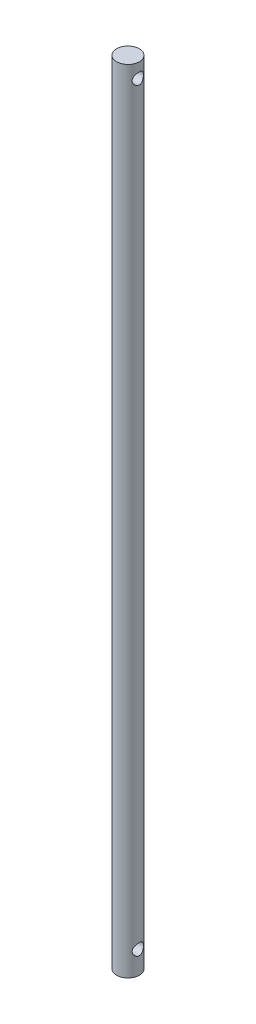
ISO-10303-21;
HEADER;
FILE_DESCRIPTION(('STEP AP214'),'2;1');
FILE_NAME('part.step','',(''),(''),'','','');
FILE_SCHEMA(('AUTOMOTIVE_DESIGN { 1 0 10303 214 1 1 1 1 }'));
ENDSEC;
DATA;
#1=APPLICATION_CONTEXT('core data for automotive mechanical design processes');
#2=APPLICATION_PROTOCOL_DEFINITION('international standard','automotive_design',2000,#1);
#3=PRODUCT_CONTEXT('',#1,'mechanical');
#4=PRODUCT('Part','Part','',(#3));
#5=PRODUCT_RELATED_PRODUCT_CATEGORY('part','',(#4));
#6=PRODUCT_DEFINITION_FORMATION('','',#4);
#7=PRODUCT_DEFINITION_CONTEXT('part definition',#1,'design');
#8=PRODUCT_DEFINITION('design','',#6,#7);
#9=PRODUCT_DEFINITION_SHAPE('','',#8);
#10=(LENGTH_UNIT() NAMED_UNIT(*) SI_UNIT(.MILLI.,.METRE.));
#11=(NAMED_UNIT(*) PLANE_ANGLE_UNIT() SI_UNIT($,.RADIAN.));
#12=(NAMED_UNIT(*) SI_UNIT($,.STERADIAN.) SOLID_ANGLE_UNIT());
#13=UNCERTAINTY_MEASURE_WITH_UNIT(LENGTH_MEASURE(1.E-05),#10,'distance_accuracy_value','');
#14=(GEOMETRIC_REPRESENTATION_CONTEXT(3) GLOBAL_UNCERTAINTY_ASSIGNED_CONTEXT((#13)) GLOBAL_UNIT_ASSIGNED_CONTEXT((#10,
#11,#12)) REPRESENTATION_CONTEXT('',''));
#15=CARTESIAN_POINT('',(0.,0.,0.));
#16=DIRECTION('',(0.,0.,1.));
#17=DIRECTION('',(1.,0.,0.));
#18=AXIS2_PLACEMENT_3D('',#15,#16,#17);
#19=CARTESIAN_POINT('',(0.,350.,0.));
#20=DIRECTION('',(0.,1.,0.));
#21=DIRECTION('',(0.,0.,1.));
#22=AXIS2_PLACEMENT_3D('',#19,#20,#21);
#23=PLANE('',#22);
#24=CARTESIAN_POINT('',(0.,350.,0.));
#25=DIRECTION('',(0.,1.,0.));
#26=DIRECTION('',(0.,0.,1.));
#27=AXIS2_PLACEMENT_3D('',#24,#25,#26);
#28=CIRCLE('',#27,5.);
#29=CARTESIAN_POINT('',(0.,350.,5.));
#30=VERTEX_POINT('',#29);
#31=EDGE_CURVE('E10',#30,#30,#28,.T.);
#32=ORIENTED_EDGE('',*,*,#31,.T.);
#33=EDGE_LOOP('',(#32));
#34=FACE_BOUND('',#33,.T.);
#35=ADVANCED_FACE('F44',(#34),#23,.T.);
#36=CARTESIAN_POINT('',(0.,0.,0.));
#37=DIRECTION('',(0.,1.,0.));
#38=DIRECTION('',(0.,0.,1.));
#39=AXIS2_PLACEMENT_3D('',#36,#37,#38);
#40=PLANE('',#39);
#41=CARTESIAN_POINT('',(0.,0.,0.));
#42=DIRECTION('',(0.,1.,0.));
#43=DIRECTION('',(0.,0.,1.));
#44=AXIS2_PLACEMENT_3D('',#41,#42,#43);
#45=CIRCLE('',#44,5.);
#46=CARTESIAN_POINT('',(0.,0.,5.));
#47=VERTEX_POINT('',#46);
#48=EDGE_CURVE('E59',#47,#47,#45,.T.);
#49=ORIENTED_EDGE('',*,*,#48,.F.);
#50=EDGE_LOOP('',(#49));
#51=FACE_BOUND('',#50,.T.);
#52=ADVANCED_FACE('F107',(#51),#40,.F.);
#53=CARTESIAN_POINT('',(0.,350.,0.));
#54=DIRECTION('',(0.,-1.,0.));
#55=DIRECTION('',(0.,0.,-1.));
#56=AXIS2_PLACEMENT_3D('',#53,#54,#55);
#57=CYLINDRICAL_SURFACE('',#56,5.);
#58=CARTESIAN_POINT('',(-4.33012701892219,343.604340322593,-2.5));
#59=CARTESIAN_POINT('',(-4.33013982272992,343.73460682947,-2.49998948436432));
#60=CARTESIAN_POINT('',(-4.33609541965583,343.86504304327,-2.48974954513168));
#61=CARTESIAN_POINT('',(-4.35905877051907,344.121909294123,-2.44930840724944));
#62=CARTESIAN_POINT('',(-4.37608974726023,344.248330326651,-2.41906526369545));
#63=CARTESIAN_POINT('',(-4.41873376871658,344.492969268154,-2.34024976997571));
#64=CARTESIAN_POINT('',(-4.4443011133892,344.611226896155,-2.29177485369965));
#65=CARTESIAN_POINT('',(-4.50106659111455,344.837900885688,-2.17816884056416));
#66=CARTESIAN_POINT('',(-4.53226502875883,344.946316714389,-2.1130368426267));
#67=CARTESIAN_POINT('',(-4.59992173524852,345.16010462651,-1.96166634317251));
#68=CARTESIAN_POINT('',(-4.63660159331578,345.264488157083,-1.87413008816916));
#69=CARTESIAN_POINT('',(-4.70929956727452,345.457861298307,-1.68313452122752));
#70=CARTESIAN_POINT('',(-4.74531734512768,345.546843230348,-1.57966731506053));
#71=CARTESIAN_POINT('',(-4.81553692452134,345.712758199079,-1.35122390789083));
#72=CARTESIAN_POINT('',(-4.84945266064072,345.788474741872,-1.22526797235895));
#73=CARTESIAN_POINT('',(-4.90876890230194,345.917192456077,-0.960392566671129));
#74=CARTESIAN_POINT('',(-4.93417477954535,345.970207963032,-0.82148134538995));
#75=CARTESIAN_POINT('',(-4.9720115311507,346.048101975757,-0.545112359773481));
#76=CARTESIAN_POINT('',(-4.98523700553426,346.074714138458,-0.408254476210946));
#77=CARTESIAN_POINT('',(-5.00018959613973,346.104755619305,-0.13142657175565));
#78=CARTESIAN_POINT('',(-5.00192366961168,346.108198964589,0.00854151460652827));
#79=CARTESIAN_POINT('',(-4.99407454791405,346.092473637662,0.274581311061977));
#80=CARTESIAN_POINT('',(-4.98546239730476,346.075245283789,0.400802997942683));
#81=CARTESIAN_POINT('',(-4.95935613149294,346.022138212833,0.64828442979512));
#82=CARTESIAN_POINT('',(-4.94186135165964,345.986258100153,0.769543802734635));
#83=CARTESIAN_POINT('',(-4.89928958219156,345.896633907368,1.00577347892408));
#84=CARTESIAN_POINT('',(-4.87411103823003,345.842649539663,1.12063355878801));
#85=CARTESIAN_POINT('',(-4.81844114966712,345.71868178209,1.33994200378329));
#86=CARTESIAN_POINT('',(-4.78794790393708,345.648692664337,1.44438662209662));
#87=CARTESIAN_POINT('',(-4.72110985998074,345.487101943761,1.65043415224552));
#88=CARTESIAN_POINT('',(-4.68448439995438,345.394082751778,1.75083518757341));
#89=CARTESIAN_POINT('',(-4.61135851467029,345.192866010268,1.93526092574445));
#90=CARTESIAN_POINT('',(-4.57485820664072,345.084656891908,2.01927302893557));
#91=CARTESIAN_POINT('',(-4.50360390231212,344.847719841533,2.17376333660552));
#92=CARTESIAN_POINT('',(-4.46910799976769,344.718125264958,2.24304328744512));
#93=CARTESIAN_POINT('',(-4.4093862569644,344.446996144196,2.35829778250307));
#94=CARTESIAN_POINT('',(-4.38415075115169,344.305474240049,2.40429664552722));
#95=CARTESIAN_POINT('',(-4.34861589542586,344.026304044386,2.4679505275626));
#96=CARTESIAN_POINT('',(-4.33729139621241,343.889237524984,2.48756280529994));
#97=CARTESIAN_POINT('',(-4.32794798404024,343.613336968802,2.50379236652857));
#98=CARTESIAN_POINT('',(-4.32991967223279,343.474504249794,2.50042589328757));
#99=CARTESIAN_POINT('',(-4.34585841351463,343.215205526146,2.4725901083599));
#100=CARTESIAN_POINT('',(-4.35848968766637,343.094391694823,2.45046954178113));
#101=CARTESIAN_POINT('',(-4.39235053878354,342.858420856916,2.38924071158109));
#102=CARTESIAN_POINT('',(-4.41358290012586,342.743265695726,2.35012694655906));
#103=CARTESIAN_POINT('',(-4.46340555199143,342.515811995337,2.25411897151213));
#104=CARTESIAN_POINT('',(-4.49229108107659,342.403892780461,2.19648515923158));
#105=CARTESIAN_POINT('',(-4.55390298743127,342.190667143744,2.06571766003965));
#106=CARTESIAN_POINT('',(-4.58663133387874,342.089366213805,1.99257601083119));
#107=CARTESIAN_POINT('',(-4.65719996140837,341.88689340379,1.82209291799633));
#108=CARTESIAN_POINT('',(-4.69516457885708,341.787347445821,1.72286318078432));
#109=CARTESIAN_POINT('',(-4.76835587444747,341.605809727587,1.50851123849876));
#110=CARTESIAN_POINT('',(-4.8035816251933,341.523823896935,1.39338368664984));
#111=CARTESIAN_POINT('',(-4.86853404227336,341.377906007802,1.14633840638502));
#112=CARTESIAN_POINT('',(-4.89809104179856,341.314507527385,1.01405774389057));
#113=CARTESIAN_POINT('',(-4.94708387398471,341.211495562631,0.73880591164729));
#114=CARTESIAN_POINT('',(-4.96652859191746,341.171861192988,0.595844253647031));
#115=CARTESIAN_POINT('',(-4.99168770453968,341.120918913237,0.317449205674674));
#116=CARTESIAN_POINT('',(-4.99849819767838,341.107345636763,0.182528609085344));
#117=CARTESIAN_POINT('',(-5.00105325940467,341.102232155099,-0.0878149643374635));
#118=CARTESIAN_POINT('',(-4.99680170177041,341.110684236932,-0.223237748727049));
#119=CARTESIAN_POINT('',(-4.97834922085636,341.147881352989,-0.481344982671107));
#120=CARTESIAN_POINT('',(-4.96482236636806,341.17525249423,-0.604280801321809));
#121=CARTESIAN_POINT('',(-4.9298023419173,341.247657772352,-0.84361487366449));
#122=CARTESIAN_POINT('',(-4.90830802955517,341.292694442227,-0.960012187087246));
#123=CARTESIAN_POINT('',(-4.85814826741487,341.401158141333,-1.18855854199596));
#124=CARTESIAN_POINT('',(-4.82921542506801,341.465289347283,-1.30031295715367));
#125=CARTESIAN_POINT('',(-4.76720333344985,341.609234432741,-1.51193650408538));
#126=CARTESIAN_POINT('',(-4.73412218229104,341.68905551522,-1.61180014305398));
#127=CARTESIAN_POINT('',(-4.66321523550925,341.871336117043,-1.80728542324369));
#128=CARTESIAN_POINT('',(-4.62524489658366,341.975258048594,-1.90149582349004));
#129=CARTESIAN_POINT('',(-4.5515769828494,342.197955607975,-2.07165660492506));
#130=CARTESIAN_POINT('',(-4.51588143910584,342.316744236793,-2.14759083151541));
#131=CARTESIAN_POINT('',(-4.44998982823925,342.570976440258,-2.2810839339603));
#132=CARTESIAN_POINT('',(-4.42000320346983,342.706827711018,-2.33798627977452));
#133=CARTESIAN_POINT('',(-4.38370272660092,342.917562972113,-2.40494911880461));
#134=CARTESIAN_POINT('',(-4.37305486646053,342.988900098291,-2.42419582683993));
#135=CARTESIAN_POINT('',(-4.35507574170934,343.133381019443,-2.4563508725579));
#136=CARTESIAN_POINT('',(-4.34774215854234,343.206523513548,-2.46926364179177));
#137=CARTESIAN_POINT('',(-4.3382377954292,343.33384130914,-2.48591166201423));
#138=CARTESIAN_POINT('',(-4.33520487024791,343.387756644105,-2.49118864979202));
#139=CARTESIAN_POINT('',(-4.33114674911323,343.495884938904,-2.49823512543934));
#140=CARTESIAN_POINT('',(-4.33012168747261,343.550097918404,-2.50000437866475));
#141=CARTESIAN_POINT('',(-4.33012701892219,343.604340322593,-2.5));
#142=B_SPLINE_CURVE_WITH_KNOTS('',3,(#58,#59,#60,#61,#62,#63,#64,#65,#66,#67,#68,#69,#70,#71,
#72,#73,#74,#75,#76,#77,#78,#79,#80,#81,#82,#83,#84,#85,#86,#87,#88,#89,#90,#91,#92,#93,#94,#95,
#96,#97,#98,#99,#100,#101,#102,#103,#104,#105,#106,#107,#108,#109,#110,#111,#112,#113,#114,#115,
#116,#117,#118,#119,#120,#121,#122,#123,#124,#125,#126,#127,#128,#129,#130,#131,#132,#133,#134,
#135,#136,#137,#138,#139,#140,#141),.UNSPECIFIED.,.T.,.F.,(4,2,2,2,2,2,2,2,2,2,2,2,2,2,2,2,2,2,
2,2,2,2,2,2,2,2,2,2,2,2,2,2,2,2,2,2,2,2,2,2,2,4),(0.,0.390580306486788,0.781982232062008,
1.17132148982688,1.56068181366373,1.98215578129643,2.4038392771601,2.85394730601993,
3.30377067414815,3.72158712424925,4.13915059220185,4.5204024371643,4.90168281298724,
5.28823836832953,5.67493248380766,6.09817978647308,6.5217512061988,6.97222104328701,
7.42221935534342,7.83655727140614,8.25060232976027,8.61935458565156,8.98822631095252,
9.37418241020316,9.76033715555206,10.1951685895662,10.630146624506,11.076604535375,
11.5226694952702,11.9278067597881,12.3328021699002,12.7111106218382,13.0894733378512,
13.4840187680377,13.8787457525688,14.3127560463025,14.7471485711797,15.1952687260161,
15.418924415395,15.6424233996908,15.8050484542806,15.9676843870379),.UNSPECIFIED.);
#143=CARTESIAN_POINT('',(-4.33012701892219,343.604340322593,-2.5));
#144=VERTEX_POINT('',#143);
#145=EDGE_CURVE('E49',#144,#144,#142,.T.);
#146=ORIENTED_EDGE('',*,*,#145,.T.);
#147=EDGE_LOOP('',(#146));
#148=FACE_BOUND('',#147,.T.);
#149=CARTESIAN_POINT('',(4.33012701892219,343.604340322593,-2.5));
#150=CARTESIAN_POINT('',(4.33013982272992,343.474073815717,-2.49998948436432));
#151=CARTESIAN_POINT('',(4.33609541965583,343.343637601917,-2.48974954513168));
#152=CARTESIAN_POINT('',(4.35905877051907,343.086771351064,-2.44930840724944));
#153=CARTESIAN_POINT('',(4.37608974726023,342.960350318536,-2.41906526369545));
#154=CARTESIAN_POINT('',(4.41873376871659,342.715711377032,-2.3402497699757));
#155=CARTESIAN_POINT('',(4.44430111338921,342.597453749031,-2.29177485369963));
#156=CARTESIAN_POINT('',(4.50106659111456,342.370779759499,-2.17816884056413));
#157=CARTESIAN_POINT('',(4.53226502875884,342.262363930798,-2.11303684262669));
#158=CARTESIAN_POINT('',(4.59992173524852,342.048576018676,-1.96166634317251));
#159=CARTESIAN_POINT('',(4.63660159331578,341.944192488104,-1.87413008816916));
#160=CARTESIAN_POINT('',(4.70929956727452,341.75081934688,-1.68313452122752));
#161=CARTESIAN_POINT('',(4.74531734512768,341.661837414838,-1.57966731506053));
#162=CARTESIAN_POINT('',(4.81553692452134,341.495922446108,-1.35122390789083));
#163=CARTESIAN_POINT('',(4.84945266064072,341.420205903314,-1.22526797235895));
#164=CARTESIAN_POINT('',(4.90876890230194,341.291488189109,-0.960392566671129));
#165=CARTESIAN_POINT('',(4.93417477954535,341.238472682155,-0.82148134538995));
#166=CARTESIAN_POINT('',(4.9720115311507,341.160578669429,-0.545112359773481));
#167=CARTESIAN_POINT('',(4.98523700553426,341.133966506728,-0.408254476210946));
#168=CARTESIAN_POINT('',(5.00018959613973,341.103925025882,-0.131426571755651));
#169=CARTESIAN_POINT('',(5.00192366961168,341.100481680598,0.00854151460652814));
#170=CARTESIAN_POINT('',(4.99407454791405,341.116207007525,0.274581311061981));
#171=CARTESIAN_POINT('',(4.98546239730476,341.133435361398,0.400802997942691));
#172=CARTESIAN_POINT('',(4.95935613149293,341.186542432353,0.648284429795127));
#173=CARTESIAN_POINT('',(4.94186135165964,341.222422545034,0.769543802734639));
#174=CARTESIAN_POINT('',(4.89928958219156,341.312046737818,1.00577347892408));
#175=CARTESIAN_POINT('',(4.87411103823003,341.366031105524,1.12063355878801));
#176=CARTESIAN_POINT('',(4.81844114966712,341.489998863097,1.33994200378329));
#177=CARTESIAN_POINT('',(4.78794790393708,341.559987980849,1.44438662209662));
#178=CARTESIAN_POINT('',(4.72110985998074,341.721578701426,1.65043415224552));
#179=CARTESIAN_POINT('',(4.68448439995438,341.814597893408,1.75083518757341));
#180=CARTESIAN_POINT('',(4.61135851467029,342.015814634919,1.93526092574445));
#181=CARTESIAN_POINT('',(4.57485820664072,342.124023753278,2.01927302893557));
#182=CARTESIAN_POINT('',(4.50360390231212,342.360960803654,2.17376333660552));
#183=CARTESIAN_POINT('',(4.46910799976769,342.490555380229,2.24304328744512));
#184=CARTESIAN_POINT('',(4.4093862569644,342.761684500991,2.35829778250307));
#185=CARTESIAN_POINT('',(4.38415075115169,342.903206405137,2.40429664552722));
#186=CARTESIAN_POINT('',(4.34861589542586,343.1823766008,2.46795052756259));
#187=CARTESIAN_POINT('',(4.33729139621241,343.319443120202,2.48756280529993));
#188=CARTESIAN_POINT('',(4.32794798404024,343.595343676385,2.50379236652857));
#189=CARTESIAN_POINT('',(4.32991967223279,343.734176395393,2.50042589328757));
#190=CARTESIAN_POINT('',(4.34585841351463,343.99347511904,2.4725901083599));
#191=CARTESIAN_POINT('',(4.35848968766637,344.114288950363,2.45046954178113));
#192=CARTESIAN_POINT('',(4.39235053878354,344.350259788271,2.38924071158109));
#193=CARTESIAN_POINT('',(4.41358290012586,344.46541494946,2.35012694655906));
#194=CARTESIAN_POINT('',(4.46340555199142,344.69286864985,2.25411897151215));
#195=CARTESIAN_POINT('',(4.49229108107658,344.804787864726,2.1964851592316));
#196=CARTESIAN_POINT('',(4.55390298743126,345.018013501442,2.06571766003968));
#197=CARTESIAN_POINT('',(4.58663133387873,345.119314431381,1.99257601083121));
#198=CARTESIAN_POINT('',(4.65719996140837,345.321787241397,1.82209291799633));
#199=CARTESIAN_POINT('',(4.69516457885708,345.421333199366,1.72286318078432));
#200=CARTESIAN_POINT('',(4.76835587444747,345.602870917599,1.50851123849876));
#201=CARTESIAN_POINT('',(4.8035816251933,345.684856748252,1.39338368664984));
#202=CARTESIAN_POINT('',(4.86853404227336,345.830774637384,1.14633840638502));
#203=CARTESIAN_POINT('',(4.89809104179856,345.894173117802,1.01405774389057));
#204=CARTESIAN_POINT('',(4.94708387398471,345.997185082555,0.73880591164729));
#205=CARTESIAN_POINT('',(4.96652859191746,346.036819452198,0.595844253647031));
#206=CARTESIAN_POINT('',(4.99168770453968,346.08776173195,0.317449205674674));
#207=CARTESIAN_POINT('',(4.99849819767838,346.101335008424,0.182528609085344));
#208=CARTESIAN_POINT('',(5.00105325940467,346.106448490088,-0.0878149643374642));
#209=CARTESIAN_POINT('',(4.99680170177041,346.097996408254,-0.223237748727049));
#210=CARTESIAN_POINT('',(4.97834922085636,346.060799292198,-0.481344982671107));
#211=CARTESIAN_POINT('',(4.96482236636806,346.033428150957,-0.604280801321809));
#212=CARTESIAN_POINT('',(4.9298023419173,345.961022872835,-0.84361487366449));
#213=CARTESIAN_POINT('',(4.90830802955517,345.91598620296,-0.960012187087246));
#214=CARTESIAN_POINT('',(4.85814826741487,345.807522503854,-1.18855854199596));
#215=CARTESIAN_POINT('',(4.82921542506801,345.743391297903,-1.30031295715367));
#216=CARTESIAN_POINT('',(4.76720333344985,345.599446212446,-1.51193650408538));
#217=CARTESIAN_POINT('',(4.73412218229104,345.519625129966,-1.61180014305398));
#218=CARTESIAN_POINT('',(4.66321523550925,345.337344528144,-1.80728542324369));
#219=CARTESIAN_POINT('',(4.62524489658366,345.233422596593,-1.90149582349004));
#220=CARTESIAN_POINT('',(4.5515769828494,345.010725037211,-2.07165660492506));
#221=CARTESIAN_POINT('',(4.51588143910584,344.891936408394,-2.14759083151541));
#222=CARTESIAN_POINT('',(4.44998982823925,344.637704204929,-2.2810839339603));
#223=CARTESIAN_POINT('',(4.42000320346983,344.501852934169,-2.33798627977452));
#224=CARTESIAN_POINT('',(4.38370272660093,344.291117673073,-2.4049491188046));
#225=CARTESIAN_POINT('',(4.37305486646054,344.219780546896,-2.42419582683991));
#226=CARTESIAN_POINT('',(4.35507574170935,344.075299625744,-2.45635087255788));
#227=CARTESIAN_POINT('',(4.34774215854234,344.002157131639,-2.46926364179176));
#228=CARTESIAN_POINT('',(4.3382377954292,343.874839336046,-2.48591166201423));
#229=CARTESIAN_POINT('',(4.33520487024791,343.820924001081,-2.49118864979202));
#230=CARTESIAN_POINT('',(4.33114674911323,343.712795706283,-2.49823512543934));
#231=CARTESIAN_POINT('',(4.33012168747261,343.658582726783,-2.50000437866475));
#232=CARTESIAN_POINT('',(4.33012701892219,343.604340322593,-2.5));
#233=B_SPLINE_CURVE_WITH_KNOTS('',3,(#149,#150,#151,#152,#153,#154,#155,#156,#157,#158,#159,
#160,#161,#162,#163,#164,#165,#166,#167,#168,#169,#170,#171,#172,#173,#174,#175,#176,#177,#178,
#179,#180,#181,#182,#183,#184,#185,#186,#187,#188,#189,#190,#191,#192,#193,#194,#195,#196,#197,
#198,#199,#200,#201,#202,#203,#204,#205,#206,#207,#208,#209,#210,#211,#212,#213,#214,#215,#216,
#217,#218,#219,#220,#221,#222,#223,#224,#225,#226,#227,#228,#229,#230,#231,#232),.UNSPECIFIED.,
.T.,.F.,(4,2,2,2,2,2,2,2,2,2,2,2,2,2,2,2,2,2,2,2,2,2,2,2,2,2,2,2,2,2,2,2,2,2,2,2,2,2,2,2,2,4),
(0.,0.390580306486788,0.781982232062008,1.17132148982695,1.56068181366373,1.98215578129643,
2.4038392771601,2.85394730601993,3.30377067414815,3.72158712424925,4.13915059220185,
4.52040243716431,4.90168281298724,5.28823836832953,5.67493248380766,6.09817978647308,
6.5217512061988,6.97222104328701,7.42221935534342,7.83655727140608,8.25060232976027,
8.61935458565156,8.98822631095252,9.37418241020304,9.76033715555206,10.1951685895662,
10.630146624506,11.076604535375,11.5226694952702,11.9278067597881,12.3328021699002,
12.7111106218382,13.0894733378512,13.4840187680377,13.8787457525688,14.3127560463025,
14.7471485711797,15.1952687260161,15.4189244153949,15.6424233996908,15.8050484542806,
15.9676843870379),.UNSPECIFIED.);
#234=CARTESIAN_POINT('',(4.33012701892219,343.604340322593,-2.5));
#235=VERTEX_POINT('',#234);
#236=EDGE_CURVE('E125',#235,#235,#233,.T.);
#237=ORIENTED_EDGE('',*,*,#236,.T.);
#238=EDGE_LOOP('',(#237));
#239=FACE_BOUND('',#238,.T.);
#240=CARTESIAN_POINT('',(-4.33012701892219,10.,-2.5));
#241=CARTESIAN_POINT('',(-4.33013982272991,10.1302665068765,-2.49998948436432));
#242=CARTESIAN_POINT('',(-4.33609541965583,10.2607027206762,-2.48974954513168));
#243=CARTESIAN_POINT('',(-4.35905877051907,10.5175689715292,-2.44930840724944));
#244=CARTESIAN_POINT('',(-4.37608974726023,10.6439900040573,-2.41906526369545));
#245=CARTESIAN_POINT('',(-4.41873376871659,10.8886289455611,-2.3402497699757));
#246=CARTESIAN_POINT('',(-4.44430111338921,11.0068865735622,-2.29177485369963));
#247=CARTESIAN_POINT('',(-4.50106659111455,11.2335605630945,-2.17816884056414));
#248=CARTESIAN_POINT('',(-4.53226502875883,11.3419763917958,-2.11303684262671));
#249=CARTESIAN_POINT('',(-4.59992173524851,11.5557643039169,-1.96166634317253));
#250=CARTESIAN_POINT('',(-4.63660159331577,11.6601478344898,-1.87413008816917));
#251=CARTESIAN_POINT('',(-4.70929956727453,11.8535209757132,-1.68313452122752));
#252=CARTESIAN_POINT('',(-4.74531734512768,11.942502907755,-1.57966731506052));
#253=CARTESIAN_POINT('',(-4.81553692452135,12.1084178764856,-1.35122390789082));
#254=CARTESIAN_POINT('',(-4.84945266064072,12.1841344192791,-1.22526797235894));
#255=CARTESIAN_POINT('',(-4.90876890230193,12.3128521334839,-0.960392566671147));
#256=CARTESIAN_POINT('',(-4.93417477954535,12.3658676404385,-0.821481345389983));
#257=CARTESIAN_POINT('',(-4.9720115311507,12.443761653164,-0.545112359773523));
#258=CARTESIAN_POINT('',(-4.98523700553425,12.4703738158651,-0.408254476210983));
#259=CARTESIAN_POINT('',(-5.00018959613973,12.5004152967113,-0.131426571755676));
#260=CARTESIAN_POINT('',(-5.00192366961168,12.5038586419954,0.00854151460650827));
#261=CARTESIAN_POINT('',(-4.99407454791405,12.4881333150686,0.274581311061964));
#262=CARTESIAN_POINT('',(-4.98546239730476,12.4709049611955,0.400802997942672));
#263=CARTESIAN_POINT('',(-4.95935613149294,12.4177978902398,0.64828442979511));
#264=CARTESIAN_POINT('',(-4.94186135165964,12.3819177775598,0.769543802734626));
#265=CARTESIAN_POINT('',(-4.89928958219156,12.2922935847751,1.00577347892407));
#266=CARTESIAN_POINT('',(-4.87411103823003,12.2383092170697,1.120633558788));
#267=CARTESIAN_POINT('',(-4.81844114966712,12.1143414594964,1.33994200378327));
#268=CARTESIAN_POINT('',(-4.78794790393709,12.0443523417442,1.4443866220966));
#269=CARTESIAN_POINT('',(-4.72110985998075,11.8827616211674,1.6504341522455));
#270=CARTESIAN_POINT('',(-4.68448439995438,11.789742429185,1.7508351875734));
#271=CARTESIAN_POINT('',(-4.61135851467029,11.5885256876746,1.93526092574445));
#272=CARTESIAN_POINT('',(-4.57485820664072,11.4803165693148,2.01927302893557));
#273=CARTESIAN_POINT('',(-4.50360390231212,11.2433795189398,2.17376333660553));
#274=CARTESIAN_POINT('',(-4.46910799976769,11.1137849423645,2.24304328744513));
#275=CARTESIAN_POINT('',(-4.40938625696439,10.8426558216025,2.35829778250308));
#276=CARTESIAN_POINT('',(-4.38415075115168,10.7011339174561,2.40429664552722));
#277=CARTESIAN_POINT('',(-4.34861589542586,10.421963721793,2.4679505275626));
#278=CARTESIAN_POINT('',(-4.33729139621241,10.2848972023911,2.48756280529994));
#279=CARTESIAN_POINT('',(-4.32794798404024,10.0089966462086,2.50379236652857));
#280=CARTESIAN_POINT('',(-4.32991967223279,9.8701639272005,2.50042589328757));
#281=CARTESIAN_POINT('',(-4.34585841351462,9.6108652035532,2.47259010835991));
#282=CARTESIAN_POINT('',(-4.35848968766635,9.49005137223027,2.45046954178116));
#283=CARTESIAN_POINT('',(-4.39235053878353,9.25408053432252,2.38924071158112));
#284=CARTESIAN_POINT('',(-4.41358290012585,9.13892537313315,2.35012694655908));
#285=CARTESIAN_POINT('',(-4.46340555199141,8.91147167274361,2.25411897151217));
#286=CARTESIAN_POINT('',(-4.49229108107657,8.79955245786744,2.19648515923163));
#287=CARTESIAN_POINT('',(-4.55390298743125,8.5863268211512,2.0657176600397));
#288=CARTESIAN_POINT('',(-4.58663133387872,8.48502589121186,1.99257601083123));
#289=CARTESIAN_POINT('',(-4.65719996140836,8.28255308119668,1.82209291799636));
#290=CARTESIAN_POINT('',(-4.69516457885708,8.18300712322778,1.72286318078435));
#291=CARTESIAN_POINT('',(-4.76835587444746,8.00146940499409,1.5085112384988));
#292=CARTESIAN_POINT('',(-4.80358162519329,7.91948357434145,1.39338368664988));
#293=CARTESIAN_POINT('',(-4.86853404227334,7.77356568520911,1.14633840638507));
#294=CARTESIAN_POINT('',(-4.89809104179855,7.71016720479154,1.01405774389062));
#295=CARTESIAN_POINT('',(-4.9470838739847,7.60715524003798,0.738805911647332));
#296=CARTESIAN_POINT('',(-4.96652859191746,7.56752087039488,0.595844253647067));
#297=CARTESIAN_POINT('',(-4.99168770453968,7.51657859064358,0.317449205674706));
#298=CARTESIAN_POINT('',(-4.99849819767838,7.50300531416965,0.182528609085376));
#299=CARTESIAN_POINT('',(-5.00105325940467,7.49789183250541,-0.087814964337431));
#300=CARTESIAN_POINT('',(-4.99680170177042,7.50634391433892,-0.223237748727017));
#301=CARTESIAN_POINT('',(-4.97834922085637,7.54354103039551,-0.481344982671073));
#302=CARTESIAN_POINT('',(-4.96482236636807,7.57091217163632,-0.604280801321773));
#303=CARTESIAN_POINT('',(-4.92980234191731,7.64331744975833,-0.843614873664455));
#304=CARTESIAN_POINT('',(-4.90830802955518,7.68835411963363,-0.960012187087214));
#305=CARTESIAN_POINT('',(-4.85814826741488,7.79681781873926,-1.18855854199593));
#306=CARTESIAN_POINT('',(-4.82921542506803,7.86094902468984,-1.30031295715363));
#307=CARTESIAN_POINT('',(-4.76720333344986,8.00489411014759,-1.51193650408535));
#308=CARTESIAN_POINT('',(-4.73412218229104,8.08471519262687,-1.61180014305397));
#309=CARTESIAN_POINT('',(-4.66321523550925,8.26699579444936,-1.8072854232437));
#310=CARTESIAN_POINT('',(-4.62524489658367,8.37091772600073,-1.90149582349002));
#311=CARTESIAN_POINT('',(-4.55157698284941,8.59361528538223,-2.07165660492503));
#312=CARTESIAN_POINT('',(-4.51588143910584,8.71240391419923,-2.1475908315154));
#313=CARTESIAN_POINT('',(-4.44998982823926,8.96663611766426,-2.28108393396028));
#314=CARTESIAN_POINT('',(-4.42000320346984,9.1024873884246,-2.3379862797745));
#315=CARTESIAN_POINT('',(-4.38370272660093,9.31322264951978,-2.40494911880459));
#316=CARTESIAN_POINT('',(-4.37305486646054,9.38455977569761,-2.42419582683991));
#317=CARTESIAN_POINT('',(-4.35507574170935,9.52904069684934,-2.45635087255789));
#318=CARTESIAN_POINT('',(-4.34774215854234,9.60218319095442,-2.46926364179176));
#319=CARTESIAN_POINT('',(-4.3382377954292,9.72950098654694,-2.48591166201423));
#320=CARTESIAN_POINT('',(-4.33520487024791,9.78341632151221,-2.49118864979202));
#321=CARTESIAN_POINT('',(-4.33114674911323,9.89154461631041,-2.49823512543934));
#322=CARTESIAN_POINT('',(-4.33012168747261,9.94575759581055,-2.50000437866475));
#323=CARTESIAN_POINT('',(-4.33012701892219,10.,-2.5));
#324=B_SPLINE_CURVE_WITH_KNOTS('',3,(#240,#241,#242,#243,#244,#245,#246,#247,#248,#249,#250,
#251,#252,#253,#254,#255,#256,#257,#258,#259,#260,#261,#262,#263,#264,#265,#266,#267,#268,#269,
#270,#271,#272,#273,#274,#275,#276,#277,#278,#279,#280,#281,#282,#283,#284,#285,#286,#287,#288,
#289,#290,#291,#292,#293,#294,#295,#296,#297,#298,#299,#300,#301,#302,#303,#304,#305,#306,#307,
#308,#309,#310,#311,#312,#313,#314,#315,#316,#317,#318,#319,#320,#321,#322,#323),.UNSPECIFIED.,
.T.,.F.,(4,2,2,2,2,2,2,2,2,2,2,2,2,2,2,2,2,2,2,2,2,2,2,2,2,2,2,2,2,2,2,2,2,2,2,2,2,2,2,2,2,4),
(0.,0.39058030648679,0.781982232062012,1.17132148982692,1.56068181366371,1.98215578129642,
2.40383927716011,2.85394730601992,3.30377067414811,3.72158712424921,4.13915059220183,
4.52040243716429,4.90168281298721,5.2882383683295,5.67493248380763,6.0981797864731,
6.5217512061988,6.97222104328704,7.42221935534346,7.83655727140613,8.25060232976016,
8.61935458565147,8.98822631095241,9.37418241020303,9.76033715555202,10.1951685895662,
10.6301466245059,11.076604535375,11.5226694952701,11.927806759788,12.3328021699001,
12.7111106218382,13.0894733378512,13.4840187680376,13.8787457525688,14.3127560463025,
14.7471485711797,15.195268726016,15.4189244153949,15.6424233996907,15.8050484542806,
15.9676843870379),.UNSPECIFIED.);
#325=CARTESIAN_POINT('',(-4.33012701892219,10.,-2.5));
#326=VERTEX_POINT('',#325);
#327=EDGE_CURVE('E81',#326,#326,#324,.T.);
#328=ORIENTED_EDGE('',*,*,#327,.T.);
#329=EDGE_LOOP('',(#328));
#330=FACE_BOUND('',#329,.T.);
#331=CARTESIAN_POINT('',(4.33012701892219,10.,-2.5));
#332=CARTESIAN_POINT('',(4.33013982272991,9.86973349312351,-2.49998948436432));
#333=CARTESIAN_POINT('',(4.33609541965583,9.73929727932375,-2.48974954513168));
#334=CARTESIAN_POINT('',(4.35905877051907,9.48243102847077,-2.44930840724944));
#335=CARTESIAN_POINT('',(4.37608974726023,9.35600999594271,-2.41906526369545));
#336=CARTESIAN_POINT('',(4.41873376871659,9.11137105443893,-2.3402497699757));
#337=CARTESIAN_POINT('',(4.44430111338921,8.99311342643779,-2.29177485369963));
#338=CARTESIAN_POINT('',(4.50106659111455,8.76643943690545,-2.17816884056414));
#339=CARTESIAN_POINT('',(4.53226502875883,8.65802360820421,-2.11303684262671));
#340=CARTESIAN_POINT('',(4.59992173524851,8.44423569608308,-1.96166634317253));
#341=CARTESIAN_POINT('',(4.63660159331577,8.33985216551023,-1.87413008816917));
#342=CARTESIAN_POINT('',(4.70929956727453,8.1464790242868,-1.68313452122752));
#343=CARTESIAN_POINT('',(4.74531734512768,8.05749709224505,-1.57966731506052));
#344=CARTESIAN_POINT('',(4.81553692452135,7.89158212351436,-1.35122390789082));
#345=CARTESIAN_POINT('',(4.84945266064072,7.81586558072086,-1.22526797235894));
#346=CARTESIAN_POINT('',(4.90876890230193,7.68714786651614,-0.960392566671147));
#347=CARTESIAN_POINT('',(4.93417477954535,7.6341323595615,-0.821481345389983));
#348=CARTESIAN_POINT('',(4.9720115311507,7.55623834683603,-0.545112359773523));
#349=CARTESIAN_POINT('',(4.98523700553425,7.52962618413487,-0.408254476210982));
#350=CARTESIAN_POINT('',(5.00018959613973,7.49958470328871,-0.131426571755676));
#351=CARTESIAN_POINT('',(5.00192366961168,7.49614135800464,0.0085415146065083));
#352=CARTESIAN_POINT('',(4.99407454791405,7.51186668493142,0.274581311061964));
#353=CARTESIAN_POINT('',(4.98546239730476,7.52909503880454,0.400802997942672));
#354=CARTESIAN_POINT('',(4.95935613149294,7.58220210976015,0.64828442979511));
#355=CARTESIAN_POINT('',(4.94186135165964,7.61808222244015,0.769543802734626));
#356=CARTESIAN_POINT('',(4.89928958219156,7.70770641522494,1.00577347892407));
#357=CARTESIAN_POINT('',(4.87411103823003,7.76169078293028,1.120633558788));
#358=CARTESIAN_POINT('',(4.81844114966712,7.88565854050362,1.33994200378327));
#359=CARTESIAN_POINT('',(4.78794790393709,7.95564765825584,1.4443866220966));
#360=CARTESIAN_POINT('',(4.72110985998075,8.11723837883257,1.6504341522455));
#361=CARTESIAN_POINT('',(4.68448439995438,8.21025757081503,1.7508351875734));
#362=CARTESIAN_POINT('',(4.61135851467029,8.41147431232543,1.93526092574445));
#363=CARTESIAN_POINT('',(4.57485820664072,8.51968343068515,2.01927302893558));
#364=CARTESIAN_POINT('',(4.50360390231212,8.75662048106022,2.17376333660553));
#365=CARTESIAN_POINT('',(4.46910799976769,8.88621505763553,2.24304328744513));
#366=CARTESIAN_POINT('',(4.4093862569644,9.15734417839749,2.35829778250308));
#367=CARTESIAN_POINT('',(4.38415075115168,9.29886608254391,2.40429664552722));
#368=CARTESIAN_POINT('',(4.34861589542586,9.57803627820697,2.4679505275626));
#369=CARTESIAN_POINT('',(4.33729139621241,9.71510279760887,2.48756280529994));
#370=CARTESIAN_POINT('',(4.32794798404024,9.99100335379136,2.50379236652857));
#371=CARTESIAN_POINT('',(4.32991967223279,10.1298360727995,2.50042589328757));
#372=CARTESIAN_POINT('',(4.34585841351462,10.3891347964468,2.47259010835991));
#373=CARTESIAN_POINT('',(4.35848968766635,10.5099486277697,2.45046954178116));
#374=CARTESIAN_POINT('',(4.39235053878353,10.7459194656775,2.38924071158112));
#375=CARTESIAN_POINT('',(4.41358290012585,10.8610746268669,2.35012694655908));
#376=CARTESIAN_POINT('',(4.46340555199141,11.0885283272564,2.25411897151217));
#377=CARTESIAN_POINT('',(4.49229108107657,11.2004475421326,2.19648515923163));
#378=CARTESIAN_POINT('',(4.55390298743125,11.4136731788488,2.0657176600397));
#379=CARTESIAN_POINT('',(4.58663133387872,11.5149741087881,1.99257601083123));
#380=CARTESIAN_POINT('',(4.65719996140836,11.7174469188033,1.82209291799636));
#381=CARTESIAN_POINT('',(4.69516457885708,11.8169928767722,1.72286318078435));
#382=CARTESIAN_POINT('',(4.76835587444746,11.9985305950059,1.5085112384988));
#383=CARTESIAN_POINT('',(4.80358162519329,12.0805164256585,1.39338368664988));
#384=CARTESIAN_POINT('',(4.86853404227334,12.2264343147909,1.14633840638507));
#385=CARTESIAN_POINT('',(4.89809104179855,12.2898327952085,1.01405774389062));
#386=CARTESIAN_POINT('',(4.9470838739847,12.392844759962,0.738805911647332));
#387=CARTESIAN_POINT('',(4.96652859191746,12.4324791296051,0.595844253647067));
#388=CARTESIAN_POINT('',(4.99168770453968,12.4834214093564,0.317449205674706));
#389=CARTESIAN_POINT('',(4.99849819767838,12.4969946858303,0.182528609085377));
#390=CARTESIAN_POINT('',(5.00105325940467,12.5021081674946,-0.0878149643374302));
#391=CARTESIAN_POINT('',(4.99680170177042,12.4936560856611,-0.223237748727016));
#392=CARTESIAN_POINT('',(4.97834922085637,12.4564589696045,-0.481344982671073));
#393=CARTESIAN_POINT('',(4.96482236636807,12.4290878283637,-0.604280801321773));
#394=CARTESIAN_POINT('',(4.92980234191731,12.3566825502417,-0.843614873664455));
#395=CARTESIAN_POINT('',(4.90830802955518,12.3116458803664,-0.960012187087213));
#396=CARTESIAN_POINT('',(4.85814826741488,12.2031821812607,-1.18855854199593));
#397=CARTESIAN_POINT('',(4.82921542506803,12.1390509753102,-1.30031295715363));
#398=CARTESIAN_POINT('',(4.76720333344986,11.9951058898524,-1.51193650408535));
#399=CARTESIAN_POINT('',(4.73412218229104,11.9152848073731,-1.61180014305397));
#400=CARTESIAN_POINT('',(4.66321523550925,11.7330042055506,-1.8072854232437));
#401=CARTESIAN_POINT('',(4.62524489658367,11.6290822739993,-1.90149582349002));
#402=CARTESIAN_POINT('',(4.55157698284941,11.4063847146178,-2.07165660492503));
#403=CARTESIAN_POINT('',(4.51588143910584,11.2875960858008,-2.1475908315154));
#404=CARTESIAN_POINT('',(4.44998982823926,11.0333638823357,-2.28108393396028));
#405=CARTESIAN_POINT('',(4.42000320346984,10.8975126115754,-2.3379862797745));
#406=CARTESIAN_POINT('',(4.38370272660093,10.6867773504802,-2.40494911880459));
#407=CARTESIAN_POINT('',(4.37305486646054,10.6154402243024,-2.42419582683991));
#408=CARTESIAN_POINT('',(4.35507574170935,10.4709593031507,-2.45635087255789));
#409=CARTESIAN_POINT('',(4.34774215854234,10.3978168090456,-2.46926364179176));
#410=CARTESIAN_POINT('',(4.3382377954292,10.2704990134531,-2.48591166201423));
#411=CARTESIAN_POINT('',(4.33520487024791,10.2165836784878,-2.49118864979202));
#412=CARTESIAN_POINT('',(4.33114674911323,10.1084553836896,-2.49823512543934));
#413=CARTESIAN_POINT('',(4.33012168747261,10.0542424041894,-2.50000437866475));
#414=CARTESIAN_POINT('',(4.33012701892219,10.,-2.5));
#415=B_SPLINE_CURVE_WITH_KNOTS('',3,(#331,#332,#333,#334,#335,#336,#337,#338,#339,#340,#341,
#342,#343,#344,#345,#346,#347,#348,#349,#350,#351,#352,#353,#354,#355,#356,#357,#358,#359,#360,
#361,#362,#363,#364,#365,#366,#367,#368,#369,#370,#371,#372,#373,#374,#375,#376,#377,#378,#379,
#380,#381,#382,#383,#384,#385,#386,#387,#388,#389,#390,#391,#392,#393,#394,#395,#396,#397,#398,
#399,#400,#401,#402,#403,#404,#405,#406,#407,#408,#409,#410,#411,#412,#413,#414),.UNSPECIFIED.,
.T.,.F.,(4,2,2,2,2,2,2,2,2,2,2,2,2,2,2,2,2,2,2,2,2,2,2,2,2,2,2,2,2,2,2,2,2,2,2,2,2,2,2,2,2,4),
(0.,0.39058030648679,0.781982232062012,1.17132148982692,1.56068181366371,1.98215578129642,
2.40383927716011,2.85394730601992,3.30377067414811,3.72158712424921,4.13915059220183,
4.52040243716429,4.90168281298721,5.2882383683295,5.67493248380763,6.0981797864731,
6.5217512061988,6.97222104328704,7.42221935534346,7.83655727140612,8.25060232976016,
8.61935458565147,8.98822631095241,9.37418241020303,9.76033715555202,10.1951685895662,
10.6301466245059,11.076604535375,11.5226694952701,11.927806759788,12.3328021699001,
12.7111106218382,13.0894733378512,13.4840187680376,13.8787457525688,14.3127560463025,
14.7471485711797,15.195268726016,15.4189244153949,15.6424233996907,15.8050484542806,
15.9676843870379),.UNSPECIFIED.);
#416=CARTESIAN_POINT('',(4.33012701892219,10.,-2.5));
#417=VERTEX_POINT('',#416);
#418=EDGE_CURVE('E73',#417,#417,#415,.T.);
#419=ORIENTED_EDGE('',*,*,#418,.T.);
#420=EDGE_LOOP('',(#419));
#421=FACE_BOUND('',#420,.T.);
#422=ORIENTED_EDGE('',*,*,#48,.T.);
#423=EDGE_LOOP('',(#422));
#424=FACE_BOUND('',#423,.T.);
#425=ORIENTED_EDGE('',*,*,#31,.F.);
#426=EDGE_LOOP('',(#425));
#427=FACE_BOUND('',#426,.T.);
#428=ADVANCED_FACE('F46',(#148,#239,#330,#421,#424,#427),#57,.T.);
#429=CARTESIAN_POINT('',(-15.,10.,0.));
#430=DIRECTION('',(1.,0.,0.));
#431=DIRECTION('',(0.,0.,-1.));
#432=AXIS2_PLACEMENT_3D('',#429,#430,#431);
#433=CYLINDRICAL_SURFACE('',#432,2.5);
#434=ORIENTED_EDGE('',*,*,#418,.F.);
#435=EDGE_LOOP('',(#434));
#436=FACE_BOUND('',#435,.T.);
#437=ORIENTED_EDGE('',*,*,#327,.F.);
#438=EDGE_LOOP('',(#437));
#439=FACE_BOUND('',#438,.T.);
#440=ADVANCED_FACE('F85',(#436,#439),#433,.F.);
#441=CARTESIAN_POINT('',(-15.,343.604340322593,0.));
#442=DIRECTION('',(1.,0.,0.));
#443=DIRECTION('',(0.,0.,-1.));
#444=AXIS2_PLACEMENT_3D('',#441,#442,#443);
#445=CYLINDRICAL_SURFACE('',#444,2.5);
#446=ORIENTED_EDGE('',*,*,#236,.F.);
#447=EDGE_LOOP('',(#446));
#448=FACE_BOUND('',#447,.T.);
#449=ORIENTED_EDGE('',*,*,#145,.F.);
#450=EDGE_LOOP('',(#449));
#451=FACE_BOUND('',#450,.T.);
#452=ADVANCED_FACE('F89',(#448,#451),#445,.F.);
#453=CLOSED_SHELL('',(#35,#52,#428,#440,#452));
#454=CARTESIAN_POINT('',(0.,320.,0.));
#455=DIRECTION('',(0.,1.,0.));
#456=DIRECTION('',(0.,0.,1.));
#457=AXIS2_PLACEMENT_3D('',#454,#455,#456);
#458=PLANE('',#457);
#459=CARTESIAN_POINT('',(0.,320.,0.));
#460=DIRECTION('',(0.,1.,0.));
#461=DIRECTION('',(0.,0.,1.));
#462=AXIS2_PLACEMENT_3D('',#459,#460,#461);
#463=CIRCLE('',#462,4.5);
#464=CARTESIAN_POINT('',(0.,320.,4.5));
#465=VERTEX_POINT('',#464);
#466=EDGE_CURVE('E65',#465,#465,#463,.T.);
#467=ORIENTED_EDGE('',*,*,#466,.F.);
#468=EDGE_LOOP('',(#467));
#469=FACE_BOUND('',#468,.T.);
#470=ADVANCED_FACE('F99',(#469),#458,.F.);
#471=CARTESIAN_POINT('',(0.,350.,0.));
#472=DIRECTION('',(0.,-1.,0.));
#473=DIRECTION('',(0.,0.,-1.));
#474=AXIS2_PLACEMENT_3D('',#471,#472,#473);
#475=CYLINDRICAL_SURFACE('',#474,4.5);
#476=ORIENTED_EDGE('',*,*,#466,.T.);
#477=EDGE_LOOP('',(#476));
#478=FACE_BOUND('',#477,.T.);
#479=CARTESIAN_POINT('',(0.,30.,0.));
#480=DIRECTION('',(0.,-1.,0.));
#481=DIRECTION('',(0.,0.,-1.));
#482=AXIS2_PLACEMENT_3D('',#479,#480,#481);
#483=CIRCLE('',#482,4.5);
#484=CARTESIAN_POINT('',(0.,30.,-4.5));
#485=VERTEX_POINT('',#484);
#486=EDGE_CURVE('E68',#485,#485,#483,.T.);
#487=ORIENTED_EDGE('',*,*,#486,.T.);
#488=EDGE_LOOP('',(#487));
#489=FACE_BOUND('',#488,.T.);
#490=ADVANCED_FACE('F96',(#478,#489),#475,.F.);
#491=CARTESIAN_POINT('',(0.,30.,0.));
#492=DIRECTION('',(0.,-1.,0.));
#493=DIRECTION('',(0.,0.,-1.));
#494=AXIS2_PLACEMENT_3D('',#491,#492,#493);
#495=PLANE('',#494);
#496=ORIENTED_EDGE('',*,*,#486,.F.);
#497=EDGE_LOOP('',(#496));
#498=FACE_BOUND('',#497,.T.);
#499=ADVANCED_FACE('F92',(#498),#495,.F.);
#500=CLOSED_SHELL('',(#470,#490,#499));
#501=ORIENTED_CLOSED_SHELL('',*,#500,.T.);
#502=BREP_WITH_VOIDS('B2',#453,(#501));
#503=ADVANCED_BREP_SHAPE_REPRESENTATION('',(#18,#502),#14);
#504=SHAPE_DEFINITION_REPRESENTATION(#9,#503);
ENDSEC;
END-ISO-10303-21;
